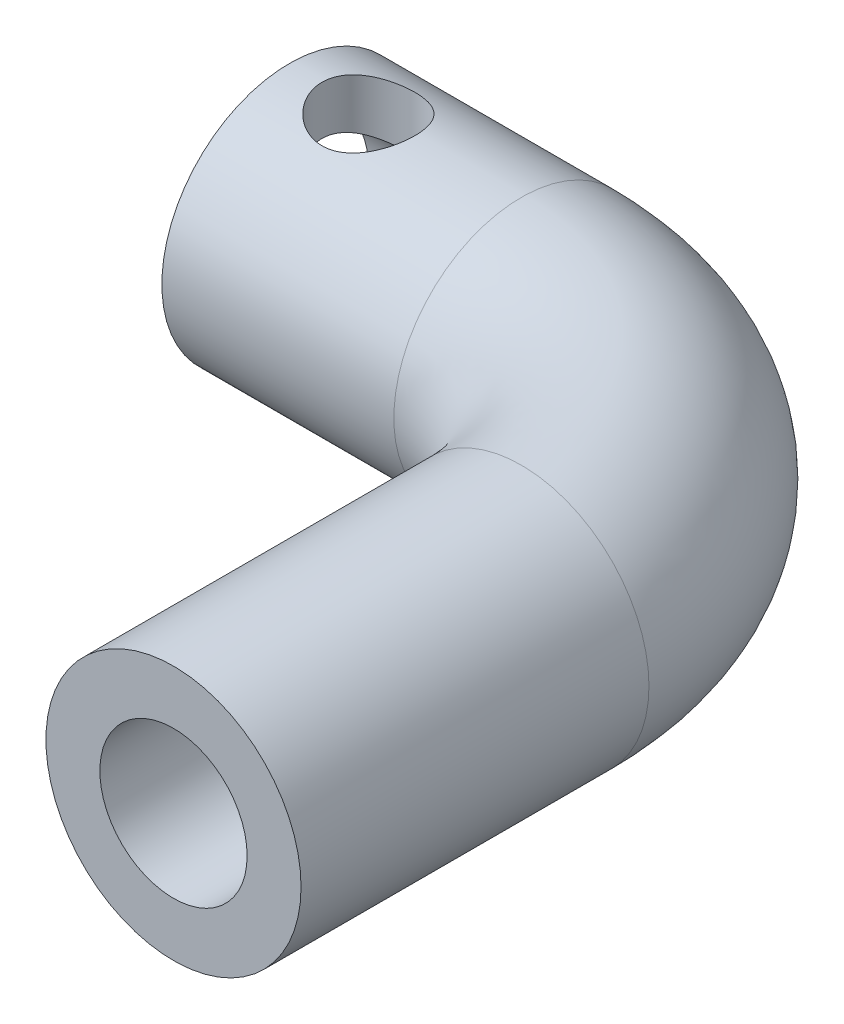
ISO-10303-21;
HEADER;
FILE_DESCRIPTION(('STEP AP214'),'2;1');
FILE_NAME('part.step','',(''),(''),'','','');
FILE_SCHEMA(('AUTOMOTIVE_DESIGN { 1 0 10303 214 1 1 1 1 }'));
ENDSEC;
DATA;
#1=APPLICATION_CONTEXT('core data for automotive mechanical design processes');
#2=APPLICATION_PROTOCOL_DEFINITION('international standard','automotive_design',2000,#1);
#3=PRODUCT_CONTEXT('',#1,'mechanical');
#4=PRODUCT('Part','Part','',(#3));
#5=PRODUCT_RELATED_PRODUCT_CATEGORY('part','',(#4));
#6=PRODUCT_DEFINITION_FORMATION('','',#4);
#7=PRODUCT_DEFINITION_CONTEXT('part definition',#1,'design');
#8=PRODUCT_DEFINITION('design','',#6,#7);
#9=PRODUCT_DEFINITION_SHAPE('','',#8);
#10=(LENGTH_UNIT() NAMED_UNIT(*) SI_UNIT(.MILLI.,.METRE.));
#11=(NAMED_UNIT(*) PLANE_ANGLE_UNIT() SI_UNIT($,.RADIAN.));
#12=(NAMED_UNIT(*) SI_UNIT($,.STERADIAN.) SOLID_ANGLE_UNIT());
#13=UNCERTAINTY_MEASURE_WITH_UNIT(LENGTH_MEASURE(1.E-05),#10,'distance_accuracy_value','');
#14=(GEOMETRIC_REPRESENTATION_CONTEXT(3) GLOBAL_UNCERTAINTY_ASSIGNED_CONTEXT((#13)) GLOBAL_UNIT_ASSIGNED_CONTEXT((#10,
#11,#12)) REPRESENTATION_CONTEXT('',''));
#15=CARTESIAN_POINT('',(0.,0.,0.));
#16=DIRECTION('',(0.,0.,1.));
#17=DIRECTION('',(1.,0.,0.));
#18=AXIS2_PLACEMENT_3D('',#15,#16,#17);
#19=CARTESIAN_POINT('',(-7.5,0.,0.));
#20=DIRECTION('',(-1.,0.,0.));
#21=DIRECTION('',(0.,0.,1.));
#22=AXIS2_PLACEMENT_3D('',#19,#20,#21);
#23=CYLINDRICAL_SURFACE('',#22,3.4);
#24=CARTESIAN_POINT('',(-14.0962512619777,2.7495454169735,-2.));
#25=CARTESIAN_POINT('',(-13.995141913617,2.74954312255691,-2.00000178173636));
#26=CARTESIAN_POINT('',(-13.8940414991926,2.75520621318379,-1.9922855520189));
#27=CARTESIAN_POINT('',(-13.6952075963007,2.77687428419416,-1.96196347122022));
#28=CARTESIAN_POINT('',(-13.5974776719335,2.79288987866686,-1.93934233816052));
#29=CARTESIAN_POINT('',(-13.4086739569529,2.83271484339308,-1.88068014919068));
#30=CARTESIAN_POINT('',(-13.3175593111926,2.85647030618881,-1.84473168470977));
#31=CARTESIAN_POINT('',(-13.1427042480847,2.90900034431594,-1.76072919784247));
#32=CARTESIAN_POINT('',(-13.0589661756797,2.93777650707736,-1.71267134460432));
#33=CARTESIAN_POINT('',(-12.8904863299819,3.00117940207663,-1.59925448413985));
#34=CARTESIAN_POINT('',(-12.8067735305978,3.03609672851945,-1.53252906792518));
#35=CARTESIAN_POINT('',(-12.6508789380163,3.10551583192648,-1.38647678749899));
#36=CARTESIAN_POINT('',(-12.5787053315724,3.14001729794361,-1.30714105548108));
#37=CARTESIAN_POINT('',(-12.4406334472446,3.20891440479631,-1.12825435669586));
#38=CARTESIAN_POINT('',(-12.3761350929615,3.24293725287067,-1.02746514462554));
#39=CARTESIAN_POINT('',(-12.2654950232315,3.30295419603564,-0.81408453072301));
#40=CARTESIAN_POINT('',(-12.2193371692729,3.32895534520286,-0.701503615601291));
#41=CARTESIAN_POINT('',(-12.1512368623606,3.36784458697935,-0.478746578288866));
#42=CARTESIAN_POINT('',(-12.1274487295891,3.38172353222183,-0.369312098373862));
#43=CARTESIAN_POINT('',(-12.0985437159299,3.39863060455052,-0.147212682806721));
#44=CARTESIAN_POINT('',(-12.093410171522,3.40166841561604,-0.0345507208865704));
#45=CARTESIAN_POINT('',(-12.1015836935822,3.39686616357349,0.176317966991322));
#46=CARTESIAN_POINT('',(-12.1127634768313,3.39028082020671,0.274645466966648));
#47=CARTESIAN_POINT('',(-12.1492337730145,3.36907356538717,0.46773468520716));
#48=CARTESIAN_POINT('',(-12.1745253283927,3.35445106022625,0.562496139494603));
#49=CARTESIAN_POINT('',(-12.2383271047138,3.31831109714109,0.74679596106887));
#50=CARTESIAN_POINT('',(-12.2769305393609,3.29674509137307,0.836292142313775));
#51=CARTESIAN_POINT('',(-12.3659482850602,3.2484690693735,1.00766327933418));
#52=CARTESIAN_POINT('',(-12.4163658381866,3.2217576414748,1.08953613445464));
#53=CARTESIAN_POINT('',(-12.5342418417189,3.16180323160523,1.25359058916515));
#54=CARTESIAN_POINT('',(-12.6030033513106,3.1281617408337,1.33468956425559));
#55=CARTESIAN_POINT('',(-12.7522422302244,3.05973183893098,1.48488009804438));
#56=CARTESIAN_POINT('',(-12.8327348043654,3.02494198535692,1.55395581428841));
#57=CARTESIAN_POINT('',(-13.013588889106,2.95372662188545,1.68573241128361));
#58=CARTESIAN_POINT('',(-13.1151600248369,2.91753678985412,1.74691549088536));
#59=CARTESIAN_POINT('',(-13.3294322889324,2.85266162936414,1.85097418240826));
#60=CARTESIAN_POINT('',(-13.4421126825034,2.82396267171176,1.89388313416404));
#61=CARTESIAN_POINT('',(-13.6476269496897,2.78454249013915,1.95121216378515));
#62=CARTESIAN_POINT('',(-13.738732450317,2.77115952934884,1.96999828010215));
#63=CARTESIAN_POINT('',(-13.923500695507,2.75343869503213,1.99469772736562));
#64=CARTESIAN_POINT('',(-14.0171605809068,2.74909109764686,2.00062489741319));
#65=CARTESIAN_POINT('',(-14.2044230212299,2.75007662951353,1.9992693894658));
#66=CARTESIAN_POINT('',(-14.2980254178555,2.75541973001623,1.99197310519339));
#67=CARTESIAN_POINT('',(-14.482399229325,2.77500994457951,1.96458443854499));
#68=CARTESIAN_POINT('',(-14.5731684182807,2.78926388325941,1.94448224817627));
#69=CARTESIAN_POINT('',(-14.7501692200076,2.82489568597514,1.89234094788884));
#70=CARTESIAN_POINT('',(-14.8363765397747,2.84630795988634,1.86024409046285));
#71=CARTESIAN_POINT('',(-15.00248954249,2.8939457771054,1.78523078152376));
#72=CARTESIAN_POINT('',(-15.0823927528845,2.92017319568965,1.74231011219448));
#73=CARTESIAN_POINT('',(-15.2484170584483,2.98001329413842,1.63820610427968));
#74=CARTESIAN_POINT('',(-15.3331845829277,3.01411561903659,1.57514204232374));
#75=CARTESIAN_POINT('',(-15.4917801865403,3.08259312297792,1.43652569250203));
#76=CARTESIAN_POINT('',(-15.565598224256,3.11696852238835,1.36096207436472));
#77=CARTESIAN_POINT('',(-15.708870534635,3.18687694206872,1.18886831058235));
#78=CARTESIAN_POINT('',(-15.7768030225527,3.22207460707675,1.09091936100233));
#79=CARTESIAN_POINT('',(-15.8948948296683,3.28521362484489,0.882706721023171));
#80=CARTESIAN_POINT('',(-15.9450670677652,3.31316024808301,0.772452058968981));
#81=CARTESIAN_POINT('',(-16.0219731401524,3.35670691024722,0.551539572231974));
#82=CARTESIAN_POINT('',(-16.0502141812169,3.37309190013547,0.441566403435734));
#83=CARTESIAN_POINT('',(-16.0876355406488,3.39490370686424,0.217399116828437));
#84=CARTESIAN_POINT('',(-16.0968353833606,3.40034174826103,0.103209444955709));
#85=CARTESIAN_POINT('',(-16.0956856373366,3.3996688982169,-0.110528194992103));
#86=CARTESIAN_POINT('',(-16.0876596729566,3.39493064963267,-0.210102832497249));
#87=CARTESIAN_POINT('',(-16.0570776988374,3.37708236665718,-0.406208539802854));
#88=CARTESIAN_POINT('',(-16.0345212458688,3.36397207689032,-0.502739516667102));
#89=CARTESIAN_POINT('',(-15.9761777536601,3.33069925412406,-0.689475295381048));
#90=CARTESIAN_POINT('',(-15.9405016415966,3.31059592247501,-0.77972580137424));
#91=CARTESIAN_POINT('',(-15.8572192066893,3.26493441105518,-0.953017929927917));
#92=CARTESIAN_POINT('',(-15.8096099950913,3.23937491068244,-1.03605780038082));
#93=CARTESIAN_POINT('',(-15.6979450027857,3.1816489342514,-1.20236485134256));
#94=CARTESIAN_POINT('',(-15.6326586019209,3.14906536420618,-1.28465955954121));
#95=CARTESIAN_POINT('',(-15.490426966442,3.08217183107915,-1.43778108351499));
#96=CARTESIAN_POINT('',(-15.4134681761358,3.04785989211488,-1.50859436491876));
#97=CARTESIAN_POINT('',(-15.2393845525531,2.97652740469595,-1.6452650827818));
#98=CARTESIAN_POINT('',(-15.1409517538372,2.93966485622156,-1.70955230258345));
#99=CARTESIAN_POINT('',(-14.9326412707378,2.87226265219749,-1.82053248367916));
#100=CARTESIAN_POINT('',(-14.8227756133751,2.84171645112599,-1.86724370025918));
#101=CARTESIAN_POINT('',(-14.6109526553577,2.7956909402467,-1.93534431879669));
#102=CARTESIAN_POINT('',(-14.5102197544848,2.77865368213732,-1.95945271841315));
#103=CARTESIAN_POINT('',(-14.3050677986604,2.75559071209684,-1.99176720870936));
#104=CARTESIAN_POINT('',(-14.2006547675404,2.74954778614252,-1.99999816021441));
#105=CARTESIAN_POINT('',(-14.0962512619777,2.7495454169735,-2.));
#106=B_SPLINE_CURVE_WITH_KNOTS('',3,(#24,#25,#26,#27,#28,#29,#30,#31,#32,#33,#34,#35,#36,#37,
#38,#39,#40,#41,#42,#43,#44,#45,#46,#47,#48,#49,#50,#51,#52,#53,#54,#55,#56,#57,#58,#59,#60,#61,
#62,#63,#64,#65,#66,#67,#68,#69,#70,#71,#72,#73,#74,#75,#76,#77,#78,#79,#80,#81,#82,#83,#84,#85,
#86,#87,#88,#89,#90,#91,#92,#93,#94,#95,#96,#97,#98,#99,#100,#101,#102,#103,#104,#105),
.UNSPECIFIED.,.T.,.F.,(4,2,2,2,2,2,2,2,2,2,2,2,2,2,2,2,2,2,2,2,2,2,2,2,2,2,2,2,2,2,2,2,2,2,2,2,
2,2,2,2,4),(0.,0.30289062038523,0.606092278400356,0.90722576116238,1.20845462852859,
1.54492915998571,1.88164136197517,2.25284144529215,2.62371416816111,2.96026475821886,
3.29651464488071,3.59264246950007,3.88879217213359,4.18705918880394,4.48540815307282,
4.81863211864369,5.15229188674118,5.52235566969769,5.89174137510558,6.17246213745344,
6.45288063131619,6.73358782570743,7.0145102715303,7.29680299825558,7.5792058990736,
7.91095996570799,8.24301641677048,8.61393466074943,8.98458253972423,9.32669239843598,
9.66845129255377,9.96702055844866,10.2655989321517,10.5617087754385,10.8578903700836,
11.1865317749333,11.5155578109672,11.8834001540491,12.2508593767008,12.5641091015236,
12.8768679421547),.UNSPECIFIED.);
#107=CARTESIAN_POINT('',(-14.0962512619777,2.7495454169735,-2.));
#108=VERTEX_POINT('',#107);
#109=EDGE_CURVE('E102',#108,#108,#106,.T.);
#110=ORIENTED_EDGE('',*,*,#109,.F.);
#111=EDGE_LOOP('',(#110));
#112=FACE_BOUND('',#111,.T.);
#113=CARTESIAN_POINT('',(-17.5,0.,0.));
#114=DIRECTION('',(-1.,0.,0.));
#115=DIRECTION('',(0.,0.,1.));
#116=AXIS2_PLACEMENT_3D('',#113,#114,#115);
#117=CIRCLE('',#116,3.4);
#118=CARTESIAN_POINT('',(-17.5,0.,3.4));
#119=VERTEX_POINT('',#118);
#120=EDGE_CURVE('E111',#119,#119,#117,.T.);
#121=ORIENTED_EDGE('',*,*,#120,.T.);
#122=EDGE_LOOP('',(#121));
#123=FACE_BOUND('',#122,.T.);
#124=DIRECTION('',(-1.,0.,0.));
#125=VECTOR('',#124,1.);
#126=CARTESIAN_POINT('',(-7.5,2.40172457996315,-2.40659906133133));
#127=LINE('',#126,#125);
#128=CARTESIAN_POINT('',(-8.5,2.40172457996315,-2.40659906133133));
#129=VERTEX_POINT('',#128);
#130=CARTESIAN_POINT('',(-7.5,2.40172457996315,-2.40659906133133));
#131=VERTEX_POINT('',#130);
#132=EDGE_CURVE('E100',#129,#131,#127,.F.);
#133=ORIENTED_EDGE('',*,*,#132,.F.);
#134=CARTESIAN_POINT('',(-8.5,0.,0.));
#135=DIRECTION('',(-1.,0.,0.));
#136=DIRECTION('',(0.,0.,1.));
#137=AXIS2_PLACEMENT_3D('',#134,#135,#136);
#138=CIRCLE('',#137,3.4);
#139=CARTESIAN_POINT('',(-8.5,2.99803015054147,-1.603688004708));
#140=VERTEX_POINT('',#139);
#141=EDGE_CURVE('E11',#129,#140,#138,.F.);
#142=ORIENTED_EDGE('',*,*,#141,.T.);
#143=DIRECTION('',(-1.,0.,0.));
#144=VECTOR('',#143,1.);
#145=CARTESIAN_POINT('',(-7.5,2.99803015054147,-1.603688004708));
#146=LINE('',#145,#144);
#147=CARTESIAN_POINT('',(-7.5,2.99803015054147,-1.603688004708));
#148=VERTEX_POINT('',#147);
#149=EDGE_CURVE('E88',#148,#140,#146,.T.);
#150=ORIENTED_EDGE('',*,*,#149,.F.);
#151=CARTESIAN_POINT('',(-7.5,0.,0.));
#152=DIRECTION('',(-1.,0.,0.));
#153=DIRECTION('',(0.,0.,1.));
#154=AXIS2_PLACEMENT_3D('',#151,#152,#153);
#155=CIRCLE('',#154,3.4);
#156=EDGE_CURVE('E112',#131,#148,#155,.T.);
#157=ORIENTED_EDGE('',*,*,#156,.F.);
#158=EDGE_LOOP('',(#133,#142,#150,#157));
#159=FACE_BOUND('',#158,.T.);
#160=ADVANCED_FACE('F35',(#112,#123,#159),#23,.F.);
#161=CARTESIAN_POINT('',(-7.5,0.,0.));
#162=DIRECTION('',(-1.,0.,0.));
#163=DIRECTION('',(0.,0.,1.));
#164=AXIS2_PLACEMENT_3D('',#161,#162,#163);
#165=PLANE('',#164);
#166=DIRECTION('',(0.,0.60876142900872,0.793353340291236));
#167=VECTOR('',#166,1.);
#168=CARTESIAN_POINT('',(-7.5,-2.87926911455578,1.64564992381975));
#169=LINE('',#168,#167);
#170=CARTESIAN_POINT('',(-7.5,-2.87926911455578,1.64564992381975));
#171=VERTEX_POINT('',#170);
#172=CARTESIAN_POINT('',(-7.5,-2.27050768554706,2.43900326411098));
#173=VERTEX_POINT('',#172);
#174=EDGE_CURVE('E95',#171,#173,#169,.T.);
#175=ORIENTED_EDGE('',*,*,#174,.F.);
#176=DIRECTION('',(0.,0.793353340291236,-0.608761429008719));
#177=VECTOR('',#176,1.);
#178=CARTESIAN_POINT('',(-7.5,-0.272241834642566,-0.354792466455033));
#179=LINE('',#178,#177);
#180=EDGE_CURVE('E43',#171,#131,#179,.T.);
#181=ORIENTED_EDGE('',*,*,#180,.T.);
#182=ORIENTED_EDGE('',*,*,#156,.T.);
#183=DIRECTION('',(0.,0.793353340291236,-0.608761429008719));
#184=VECTOR('',#183,1.);
#185=CARTESIAN_POINT('',(-7.5,-2.27050768554706,2.43900326411098));
#186=LINE('',#185,#184);
#187=EDGE_CURVE('E80',#173,#148,#186,.T.);
#188=ORIENTED_EDGE('',*,*,#187,.F.);
#189=EDGE_LOOP('',(#175,#181,#182,#188));
#190=FACE_BOUND('',#189,.T.);
#191=ADVANCED_FACE('F125',(#190),#165,.T.);
#192=CARTESIAN_POINT('',(-7.50000000000005,0.,0.));
#193=DIRECTION('',(-1.,0.,0.));
#194=DIRECTION('',(0.,0.,1.));
#195=AXIS2_PLACEMENT_3D('',#192,#193,#194);
#196=CYLINDRICAL_SURFACE('',#195,5.5);
#197=CARTESIAN_POINT('',(-17.5,0.,0.));
#198=DIRECTION('',(1.,0.,0.));
#199=DIRECTION('',(0.,0.,-1.));
#200=AXIS2_PLACEMENT_3D('',#197,#198,#199);
#201=CIRCLE('',#200,5.5);
#202=CARTESIAN_POINT('',(-17.5,0.,-5.5));
#203=VERTEX_POINT('',#202);
#204=EDGE_CURVE('E134',#203,#203,#201,.T.);
#205=ORIENTED_EDGE('',*,*,#204,.T.);
#206=EDGE_LOOP('',(#205));
#207=FACE_BOUND('',#206,.T.);
#208=CARTESIAN_POINT('',(-7.50000000000005,0.,0.));
#209=DIRECTION('',(1.,0.,0.));
#210=DIRECTION('',(0.,0.,-1.));
#211=AXIS2_PLACEMENT_3D('',#208,#209,#210);
#212=CIRCLE('',#211,5.5);
#213=CARTESIAN_POINT('',(-7.50000000000008,0.,-5.5));
#214=VERTEX_POINT('',#213);
#215=EDGE_CURVE('E171',#214,#214,#212,.T.);
#216=ORIENTED_EDGE('',*,*,#215,.F.);
#217=EDGE_LOOP('',(#216));
#218=FACE_BOUND('',#217,.T.);
#219=CARTESIAN_POINT('',(-16.0962512619777,5.5,0.));
#220=CARTESIAN_POINT('',(-16.0962540749037,5.50000205657184,0.108543167224903));
#221=CARTESIAN_POINT('',(-16.0873870672319,5.49675838182447,0.217066536046161));
#222=CARTESIAN_POINT('',(-16.05228680681,5.4841414750815,0.430882793323262));
#223=CARTESIAN_POINT('',(-16.026054888442,5.47476871406757,0.536175929351336));
#224=CARTESIAN_POINT('',(-15.9572665501313,5.45090325673945,0.740417965464447));
#225=CARTESIAN_POINT('',(-15.9147404536697,5.43642007485985,0.839378254121704));
#226=CARTESIAN_POINT('',(-15.8147203138637,5.4037862710006,1.02875621286126));
#227=CARTESIAN_POINT('',(-15.7572225233078,5.38563473113581,1.11917173657256));
#228=CARTESIAN_POINT('',(-15.6264672787922,5.34673088503245,1.29253694990834));
#229=CARTESIAN_POINT('',(-15.5527132142648,5.32590805596802,1.37509612786369));
#230=CARTESIAN_POINT('',(-15.3925935131786,5.28436672781322,1.52698399161499));
#231=CARTESIAN_POINT('',(-15.306224355575,5.26364825952702,1.59630897106152));
#232=CARTESIAN_POINT('',(-15.1195962124677,5.2238538559819,1.72217040965031));
#233=CARTESIAN_POINT('',(-15.0189539897892,5.20486193866807,1.77816779943083));
#234=CARTESIAN_POINT('',(-14.8088797859481,5.17176122573932,1.87226939440076));
#235=CARTESIAN_POINT('',(-14.6994510953729,5.15765061245797,1.91038026194013));
#236=CARTESIAN_POINT('',(-14.4793926052292,5.13666087499578,1.9661067634546));
#237=CARTESIAN_POINT('',(-14.3689763262856,5.12952103621697,1.98446417009746));
#238=CARTESIAN_POINT('',(-14.1464175062078,5.12251577517209,2.00248218153331));
#239=CARTESIAN_POINT('',(-14.0342756408192,5.12264757431404,2.0021499278993));
#240=CARTESIAN_POINT('',(-13.8180990594426,5.1299448506341,1.98336767767184));
#241=CARTESIAN_POINT('',(-13.7139608567425,5.13671788212537,1.96592854222369));
#242=CARTESIAN_POINT('',(-13.5102048002903,5.15588510806292,1.91509242052769));
#243=CARTESIAN_POINT('',(-13.4105875885507,5.16828009813625,1.88169317554809));
#244=CARTESIAN_POINT('',(-13.2165748993959,5.19754287313288,1.79930048548219));
#245=CARTESIAN_POINT('',(-13.1223073219326,5.21448789682278,1.75003450500502));
#246=CARTESIAN_POINT('',(-12.9430765104296,5.25091385937534,1.63749646562567));
#247=CARTESIAN_POINT('',(-12.8581163634627,5.27039563496267,1.57421978057422));
#248=CARTESIAN_POINT('',(-12.694291552473,5.31119569956226,1.43076675943658));
#249=CARTESIAN_POINT('',(-12.6161463481083,5.33255243042912,1.34977782823104));
#250=CARTESIAN_POINT('',(-12.4743402514832,5.3736374984068,1.17559287826596));
#251=CARTESIAN_POINT('',(-12.4106813274115,5.39336561401291,1.08239520346403));
#252=CARTESIAN_POINT('',(-12.2989240994863,5.42932219694274,0.88469148247814));
#253=CARTESIAN_POINT('',(-12.2510520390387,5.44549875602857,0.780047440423985));
#254=CARTESIAN_POINT('',(-12.1738261193611,5.47214720693442,0.563457919122987));
#255=CARTESIAN_POINT('',(-12.1444645464187,5.48262147477141,0.451515502750676));
#256=CARTESIAN_POINT('',(-12.1064452489037,5.49627428963535,0.229572167352699));
#257=CARTESIAN_POINT('',(-12.0968177974848,5.49979422865534,0.119758188935125));
#258=CARTESIAN_POINT('',(-12.0957337267991,5.50018795318754,-0.099959133562812));
#259=CARTESIAN_POINT('',(-12.1042733610299,5.49706310901842,-0.209862454546218));
#260=CARTESIAN_POINT('',(-12.1385346683936,5.48474392235953,-0.42253626073088));
#261=CARTESIAN_POINT('',(-12.1636324866368,5.47577009231647,-0.525421334588075));
#262=CARTESIAN_POINT('',(-12.2294881181432,5.45287588831335,-0.725457170096086));
#263=CARTESIAN_POINT('',(-12.2702479682028,5.43895487100538,-0.822607184024532));
#264=CARTESIAN_POINT('',(-12.3675468187183,5.40705571750078,-1.01153077639211));
#265=CARTESIAN_POINT('',(-12.4245046117121,5.38897272874452,-1.10307043335863));
#266=CARTESIAN_POINT('',(-12.5521043618453,5.35076522574993,-1.27559067705659));
#267=CARTESIAN_POINT('',(-12.6227511472205,5.3306399923892,-1.35656752127386));
#268=CARTESIAN_POINT('',(-12.7802590501279,5.28921180356834,-1.51027155013883));
#269=CARTESIAN_POINT('',(-12.8677938201049,5.26790441656513,-1.58230898792662));
#270=CARTESIAN_POINT('',(-13.0541422454302,5.22759328693503,-1.71079410152422));
#271=CARTESIAN_POINT('',(-13.1529566062335,5.20858968854653,-1.76724080149289));
#272=CARTESIAN_POINT('',(-13.3596242092117,5.1751541927476,-1.86289185191077));
#273=CARTESIAN_POINT('',(-13.4674960600196,5.16073201356674,-1.90205961728944));
#274=CARTESIAN_POINT('',(-13.6889687098691,5.13846087649098,-1.96143954674718));
#275=CARTESIAN_POINT('',(-13.8025662107052,5.13060817917034,-1.98166249522347));
#276=CARTESIAN_POINT('',(-14.024842570137,5.12284228170685,-2.00164701057721));
#277=CARTESIAN_POINT('',(-14.1334016297174,5.1224762355533,-2.00257568987819));
#278=CARTESIAN_POINT('',(-14.349040828731,5.12857566975998,-1.98690232545375));
#279=CARTESIAN_POINT('',(-14.4561210910641,5.13504057890957,-1.97030174754071));
#280=CARTESIAN_POINT('',(-14.6628462177125,5.15370717596286,-1.92092825934282));
#281=CARTESIAN_POINT('',(-14.7626137211752,5.16574946028865,-1.88860353628273));
#282=CARTESIAN_POINT('',(-14.9553740420676,5.19413013423955,-1.80908422608117));
#283=CARTESIAN_POINT('',(-15.0483651912345,5.21046957724445,-1.76188599237303));
#284=CARTESIAN_POINT('',(-15.2299927161777,5.24662240525316,-1.6512114794778));
#285=CARTESIAN_POINT('',(-15.3181776581623,5.26656880255672,-1.58703826418065));
#286=CARTESIAN_POINT('',(-15.4829014136564,5.30720401505186,-1.44534172486944));
#287=CARTESIAN_POINT('',(-15.5594366266818,5.32789305733489,-1.36781428929525));
#288=CARTESIAN_POINT('',(-15.7025507282668,5.36891606148755,-1.19700369898172));
#289=CARTESIAN_POINT('',(-15.7684467617807,5.38918141250994,-1.10312945402949));
#290=CARTESIAN_POINT('',(-15.8834883375495,5.42597802894301,-0.90493584787187));
#291=CARTESIAN_POINT('',(-15.9326342450026,5.44250937576248,-0.800616714457644));
#292=CARTESIAN_POINT('',(-16.0131609298506,5.47019903727863,-0.582422816702627));
#293=CARTESIAN_POINT('',(-16.0442026659552,5.48125425902285,-0.468408860492773));
#294=CARTESIAN_POINT('',(-16.0857419075774,5.49615207881264,-0.236254263243528));
#295=CARTESIAN_POINT('',(-16.0962482009844,5.49999776206249,-0.118115409443586));
#296=CARTESIAN_POINT('',(-16.0962512619777,5.5,0.));
#297=B_SPLINE_CURVE_WITH_KNOTS('',3,(#219,#220,#221,#222,#223,#224,#225,#226,#227,#228,#229,
#230,#231,#232,#233,#234,#235,#236,#237,#238,#239,#240,#241,#242,#243,#244,#245,#246,#247,#248,
#249,#250,#251,#252,#253,#254,#255,#256,#257,#258,#259,#260,#261,#262,#263,#264,#265,#266,#267,
#268,#269,#270,#271,#272,#273,#274,#275,#276,#277,#278,#279,#280,#281,#282,#283,#284,#285,#286,
#287,#288,#289,#290,#291,#292,#293,#294,#295,#296),.UNSPECIFIED.,.T.,.F.,(4,2,2,2,2,2,2,2,2,2,2,
2,2,2,2,2,2,2,2,2,2,2,2,2,2,2,2,2,2,2,2,2,2,2,2,2,2,2,4),(0.,0.325194104136432,
0.650363222090041,0.97493011631894,1.2995783234422,1.63601964163853,1.97255504528971,
2.32099392094054,2.66930290729856,3.00401939097087,3.33860797579857,3.65454759073094,
3.97053193181531,4.29226244373356,4.61409934564611,4.95617818949658,5.29830348241717,
5.64513792605579,5.99182774072784,6.32102805388949,6.65016048438683,6.96755079702181,
7.2849823992121,7.61151258405805,7.93815814949471,8.28259860829996,8.62706062112335,
8.97224851093866,9.31723978183251,9.64129740492555,9.96532793217199,10.2806204101951,
10.5959902492892,10.9271566786297,11.2584252518918,11.6061385710831,11.9538443086926,
12.3078682758854,12.6617407096898),.UNSPECIFIED.);
#298=CARTESIAN_POINT('',(-16.0962512619777,5.5,0.));
#299=VERTEX_POINT('',#298);
#300=EDGE_CURVE('E103',#299,#299,#297,.T.);
#301=ORIENTED_EDGE('',*,*,#300,.F.);
#302=EDGE_LOOP('',(#301));
#303=FACE_BOUND('',#302,.T.);
#304=ADVANCED_FACE('F114',(#207,#218,#303),#196,.T.);
#305=CARTESIAN_POINT('',(2.5,0.,25.));
#306=DIRECTION('',(0.,0.,1.));
#307=DIRECTION('',(1.,0.,0.));
#308=AXIS2_PLACEMENT_3D('',#305,#306,#307);
#309=PLANE('',#308);
#310=CARTESIAN_POINT('',(2.5,0.,25.));
#311=DIRECTION('',(0.,0.,1.));
#312=DIRECTION('',(1.,0.,0.));
#313=AXIS2_PLACEMENT_3D('',#310,#311,#312);
#314=CIRCLE('',#313,3.175);
#315=CARTESIAN_POINT('',(5.675,0.,25.));
#316=VERTEX_POINT('',#315);
#317=EDGE_CURVE('E182',#316,#316,#314,.T.);
#318=ORIENTED_EDGE('',*,*,#317,.F.);
#319=EDGE_LOOP('',(#318));
#320=FACE_BOUND('',#319,.T.);
#321=CARTESIAN_POINT('',(2.5,0.,25.));
#322=DIRECTION('',(0.,0.,1.));
#323=DIRECTION('',(1.,0.,0.));
#324=AXIS2_PLACEMENT_3D('',#321,#322,#323);
#325=CIRCLE('',#324,5.5);
#326=CARTESIAN_POINT('',(8.,0.,25.));
#327=VERTEX_POINT('',#326);
#328=EDGE_CURVE('E176',#327,#327,#325,.T.);
#329=ORIENTED_EDGE('',*,*,#328,.T.);
#330=EDGE_LOOP('',(#329));
#331=FACE_BOUND('',#330,.T.);
#332=ADVANCED_FACE('F37',(#320,#331),#309,.T.);
#333=CARTESIAN_POINT('',(-17.5,0.,0.));
#334=DIRECTION('',(1.,0.,0.));
#335=DIRECTION('',(0.,0.,-1.));
#336=AXIS2_PLACEMENT_3D('',#333,#334,#335);
#337=PLANE('',#336);
#338=ORIENTED_EDGE('',*,*,#120,.F.);
#339=EDGE_LOOP('',(#338));
#340=FACE_BOUND('',#339,.T.);
#341=ORIENTED_EDGE('',*,*,#204,.F.);
#342=EDGE_LOOP('',(#341));
#343=FACE_BOUND('',#342,.T.);
#344=ADVANCED_FACE('F150',(#340,#343),#337,.F.);
#345=CARTESIAN_POINT('',(2.5,0.,25.));
#346=DIRECTION('',(0.,0.,-1.));
#347=DIRECTION('',(-1.,0.,0.));
#348=AXIS2_PLACEMENT_3D('',#345,#346,#347);
#349=CYLINDRICAL_SURFACE('',#348,5.5);
#350=CARTESIAN_POINT('',(2.5,0.,10.));
#351=DIRECTION('',(0.,0.,1.));
#352=DIRECTION('',(1.,0.,0.));
#353=AXIS2_PLACEMENT_3D('',#350,#351,#352);
#354=CIRCLE('',#353,5.5);
#355=CARTESIAN_POINT('',(8.,0.,10.));
#356=VERTEX_POINT('',#355);
#357=EDGE_CURVE('E174',#356,#356,#354,.T.);
#358=ORIENTED_EDGE('',*,*,#357,.T.);
#359=EDGE_LOOP('',(#358));
#360=FACE_BOUND('',#359,.T.);
#361=ORIENTED_EDGE('',*,*,#328,.F.);
#362=EDGE_LOOP('',(#361));
#363=FACE_BOUND('',#362,.T.);
#364=ADVANCED_FACE('F148',(#360,#363),#349,.T.);
#365=CARTESIAN_POINT('',(-7.5,0.,10.));
#366=DIRECTION('',(0.,1.,0.));
#367=DIRECTION('',(0.,0.,1.));
#368=AXIS2_PLACEMENT_3D('',#365,#366,#367);
#369=TOROIDAL_SURFACE('',#368,10.,5.5);
#370=CARTESIAN_POINT('',(-7.5,0.,10.));
#371=DIRECTION('',(0.,1.,0.));
#372=DIRECTION('',(0.,0.,1.));
#373=AXIS2_PLACEMENT_3D('',#370,#371,#372);
#374=CIRCLE('',#373,15.5);
#375=EDGE_CURVE('',#356,#214,#374,.T.);
#376=ORIENTED_EDGE('',*,*,#357,.F.);
#377=ORIENTED_EDGE('',*,*,#215,.T.);
#378=ORIENTED_EDGE('',*,*,#375,.T.);
#379=ORIENTED_EDGE('',*,*,#375,.F.);
#380=EDGE_LOOP('',(#376,#378,#377,#379));
#381=FACE_BOUND('',#380,.T.);
#382=ADVANCED_FACE('F146',(#381),#369,.T.);
#383=CARTESIAN_POINT('',(2.5,0.,15.));
#384=DIRECTION('',(0.,0.,1.));
#385=DIRECTION('',(1.,0.,0.));
#386=AXIS2_PLACEMENT_3D('',#383,#384,#385);
#387=CYLINDRICAL_SURFACE('',#386,3.175);
#388=CARTESIAN_POINT('',(2.5,0.,15.));
#389=DIRECTION('',(0.,0.,1.));
#390=DIRECTION('',(1.,0.,0.));
#391=AXIS2_PLACEMENT_3D('',#388,#389,#390);
#392=CIRCLE('',#391,3.175);
#393=CARTESIAN_POINT('',(5.675,0.,15.));
#394=VERTEX_POINT('',#393);
#395=EDGE_CURVE('E181',#394,#394,#392,.T.);
#396=ORIENTED_EDGE('',*,*,#395,.F.);
#397=EDGE_LOOP('',(#396));
#398=FACE_BOUND('',#397,.T.);
#399=ORIENTED_EDGE('',*,*,#317,.T.);
#400=EDGE_LOOP('',(#399));
#401=FACE_BOUND('',#400,.T.);
#402=ADVANCED_FACE('F142',(#398,#401),#387,.F.);
#403=CARTESIAN_POINT('',(2.5,0.,15.));
#404=DIRECTION('',(0.,0.,1.));
#405=DIRECTION('',(1.,0.,0.));
#406=AXIS2_PLACEMENT_3D('',#403,#404,#405);
#407=PLANE('',#406);
#408=ORIENTED_EDGE('',*,*,#395,.T.);
#409=EDGE_LOOP('',(#408));
#410=FACE_BOUND('',#409,.T.);
#411=ADVANCED_FACE('F122',(#410),#407,.T.);
#412=CARTESIAN_POINT('',(-14.0962512619777,5.5,0.));
#413=DIRECTION('',(0.,-1.,0.));
#414=DIRECTION('',(0.,0.,-1.));
#415=AXIS2_PLACEMENT_3D('',#412,#413,#414);
#416=CYLINDRICAL_SURFACE('',#415,2.);
#417=ORIENTED_EDGE('',*,*,#109,.T.);
#418=EDGE_LOOP('',(#417));
#419=FACE_BOUND('',#418,.T.);
#420=ORIENTED_EDGE('',*,*,#300,.T.);
#421=EDGE_LOOP('',(#420));
#422=FACE_BOUND('',#421,.T.);
#423=ADVANCED_FACE('F117',(#419,#422),#416,.F.);
#424=CARTESIAN_POINT('',(-8.5,0.,0.));
#425=DIRECTION('',(-1.,0.,0.));
#426=DIRECTION('',(0.,0.,1.));
#427=AXIS2_PLACEMENT_3D('',#424,#425,#426);
#428=PLANE('',#427);
#429=ORIENTED_EDGE('',*,*,#141,.F.);
#430=DIRECTION('',(0.,-0.793353340291236,0.608761429008719));
#431=VECTOR('',#430,1.);
#432=CARTESIAN_POINT('',(-8.5,-2.87926911455578,1.64564992381975));
#433=LINE('',#432,#431);
#434=CARTESIAN_POINT('',(-8.5,-2.87926911455578,1.64564992381975));
#435=VERTEX_POINT('',#434);
#436=EDGE_CURVE('E73',#129,#435,#433,.T.);
#437=ORIENTED_EDGE('',*,*,#436,.T.);
#438=DIRECTION('',(0.,0.60876142900872,0.793353340291236));
#439=VECTOR('',#438,1.);
#440=CARTESIAN_POINT('',(-8.5,-2.87926911455578,1.64564992381975));
#441=LINE('',#440,#439);
#442=CARTESIAN_POINT('',(-8.5,-2.27050768554706,2.43900326411098));
#443=VERTEX_POINT('',#442);
#444=EDGE_CURVE('E77',#435,#443,#441,.T.);
#445=ORIENTED_EDGE('',*,*,#444,.T.);
#446=DIRECTION('',(0.,0.793353340291236,-0.608761429008719));
#447=VECTOR('',#446,1.);
#448=CARTESIAN_POINT('',(-8.5,-2.27050768554706,2.43900326411098));
#449=LINE('',#448,#447);
#450=EDGE_CURVE('E91',#443,#140,#449,.T.);
#451=ORIENTED_EDGE('',*,*,#450,.T.);
#452=EDGE_LOOP('',(#429,#437,#445,#451));
#453=FACE_BOUND('',#452,.T.);
#454=ADVANCED_FACE('F75',(#453),#428,.T.);
#455=CARTESIAN_POINT('',(-8.5,-2.87926911455578,1.64564992381975));
#456=DIRECTION('',(0.,0.608761429008719,0.793353340291236));
#457=DIRECTION('',(0.,-0.793353340291236,0.608761429008719));
#458=AXIS2_PLACEMENT_3D('',#455,#456,#457);
#459=PLANE('',#458);
#460=ORIENTED_EDGE('',*,*,#436,.F.);
#461=ORIENTED_EDGE('',*,*,#132,.T.);
#462=ORIENTED_EDGE('',*,*,#180,.F.);
#463=DIRECTION('',(1.,0.,0.));
#464=VECTOR('',#463,1.);
#465=CARTESIAN_POINT('',(-8.5,-2.87926911455578,1.64564992381975));
#466=LINE('',#465,#464);
#467=EDGE_CURVE('E83',#435,#171,#466,.T.);
#468=ORIENTED_EDGE('',*,*,#467,.F.);
#469=EDGE_LOOP('',(#460,#461,#462,#468));
#470=FACE_BOUND('',#469,.T.);
#471=ADVANCED_FACE('F84',(#470),#459,.F.);
#472=CARTESIAN_POINT('',(-8.5,-2.27050768554706,2.43900326411098));
#473=DIRECTION('',(0.,-0.608761429008719,-0.793353340291236));
#474=DIRECTION('',(0.,0.793353340291236,-0.608761429008719));
#475=AXIS2_PLACEMENT_3D('',#472,#473,#474);
#476=PLANE('',#475);
#477=ORIENTED_EDGE('',*,*,#187,.T.);
#478=ORIENTED_EDGE('',*,*,#149,.T.);
#479=ORIENTED_EDGE('',*,*,#450,.F.);
#480=DIRECTION('',(1.,0.,0.));
#481=VECTOR('',#480,1.);
#482=CARTESIAN_POINT('',(-8.5,-2.27050768554706,2.43900326411098));
#483=LINE('',#482,#481);
#484=EDGE_CURVE('E50',#443,#173,#483,.T.);
#485=ORIENTED_EDGE('',*,*,#484,.T.);
#486=EDGE_LOOP('',(#477,#478,#479,#485));
#487=FACE_BOUND('',#486,.T.);
#488=ADVANCED_FACE('F194',(#487),#476,.F.);
#489=CARTESIAN_POINT('',(-8.5,-2.87926911455578,1.64564992381975));
#490=DIRECTION('',(0.,0.793353340291236,-0.60876142900872));
#491=DIRECTION('',(0.,0.60876142900872,0.793353340291236));
#492=AXIS2_PLACEMENT_3D('',#489,#490,#491);
#493=PLANE('',#492);
#494=ORIENTED_EDGE('',*,*,#174,.T.);
#495=ORIENTED_EDGE('',*,*,#484,.F.);
#496=ORIENTED_EDGE('',*,*,#444,.F.);
#497=ORIENTED_EDGE('',*,*,#467,.T.);
#498=EDGE_LOOP('',(#494,#495,#496,#497));
#499=FACE_BOUND('',#498,.T.);
#500=ADVANCED_FACE('F90',(#499),#493,.F.);
#501=CLOSED_SHELL('',(#160,#191,#304,#332,#344,#364,#382,#402,#411,#423,#454,#471,#488,#500));
#502=MANIFOLD_SOLID_BREP('B2',#501);
#503=ADVANCED_BREP_SHAPE_REPRESENTATION('',(#18,#502),#14);
#504=SHAPE_DEFINITION_REPRESENTATION(#9,#503);
ENDSEC;
END-ISO-10303-21;
